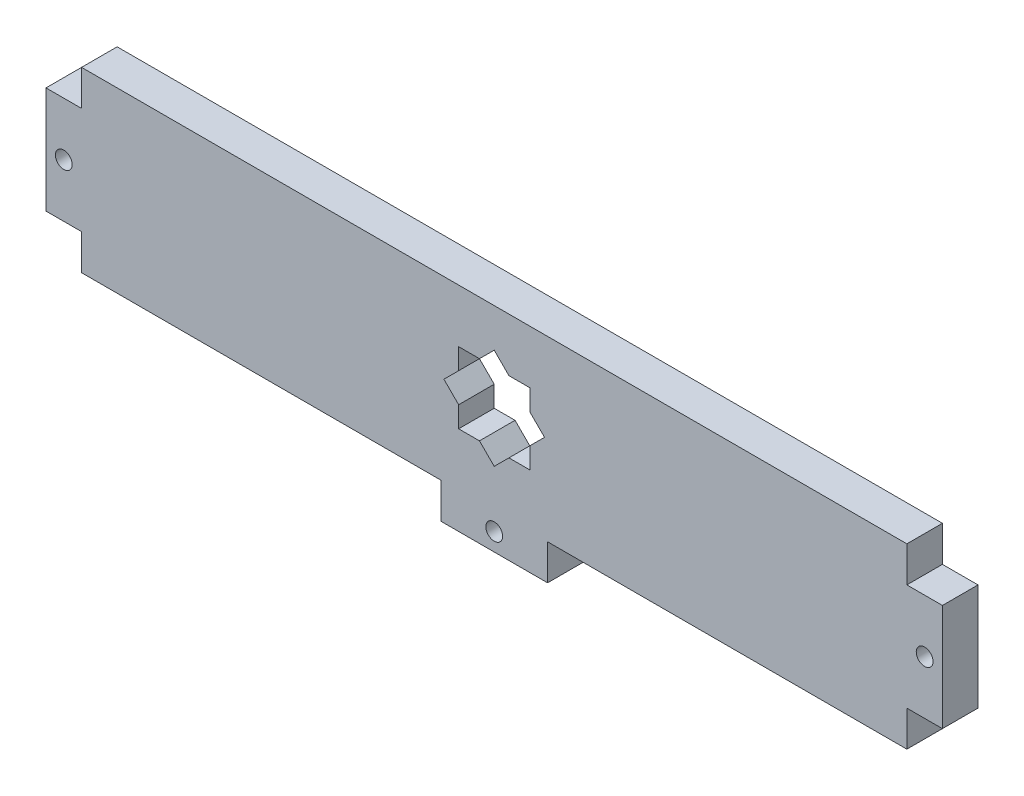
ISO-10303-21;
HEADER;
FILE_DESCRIPTION(('STEP AP214'),'2;1');
FILE_NAME('part.step','',(''),(''),'','','');
FILE_SCHEMA(('AUTOMOTIVE_DESIGN { 1 0 10303 214 1 1 1 1 }'));
ENDSEC;
DATA;
#1=APPLICATION_CONTEXT('core data for automotive mechanical design processes');
#2=APPLICATION_PROTOCOL_DEFINITION('international standard','automotive_design',2000,#1);
#3=PRODUCT_CONTEXT('',#1,'mechanical');
#4=PRODUCT('Part','Part','',(#3));
#5=PRODUCT_RELATED_PRODUCT_CATEGORY('part','',(#4));
#6=PRODUCT_DEFINITION_FORMATION('','',#4);
#7=PRODUCT_DEFINITION_CONTEXT('part definition',#1,'design');
#8=PRODUCT_DEFINITION('design','',#6,#7);
#9=PRODUCT_DEFINITION_SHAPE('','',#8);
#10=(LENGTH_UNIT() NAMED_UNIT(*) SI_UNIT(.MILLI.,.METRE.));
#11=(NAMED_UNIT(*) PLANE_ANGLE_UNIT() SI_UNIT($,.RADIAN.));
#12=(NAMED_UNIT(*) SI_UNIT($,.STERADIAN.) SOLID_ANGLE_UNIT());
#13=UNCERTAINTY_MEASURE_WITH_UNIT(LENGTH_MEASURE(1.E-05),#10,'distance_accuracy_value','');
#14=(GEOMETRIC_REPRESENTATION_CONTEXT(3) GLOBAL_UNCERTAINTY_ASSIGNED_CONTEXT((#13)) GLOBAL_UNIT_ASSIGNED_CONTEXT((#10,
#11,#12)) REPRESENTATION_CONTEXT('',''));
#15=CARTESIAN_POINT('',(0.,0.,0.));
#16=DIRECTION('',(0.,0.,1.));
#17=DIRECTION('',(1.,0.,0.));
#18=AXIS2_PLACEMENT_3D('',#15,#16,#17);
#19=CARTESIAN_POINT('',(-73.66,-15.875,-6.35));
#20=DIRECTION('',(0.,-1.,0.));
#21=DIRECTION('',(0.,0.,-1.));
#22=AXIS2_PLACEMENT_3D('',#19,#20,#21);
#23=PLANE('',#22);
#24=DIRECTION('',(1.,0.,0.));
#25=VECTOR('',#24,1.);
#26=CARTESIAN_POINT('',(-73.66,-15.875,-6.35));
#27=LINE('',#26,#25);
#28=CARTESIAN_POINT('',(-73.66,-15.875,-6.35));
#29=VERTEX_POINT('',#28);
#30=CARTESIAN_POINT('',(-9.52500000000007,-15.875,-6.35));
#31=VERTEX_POINT('',#30);
#32=EDGE_CURVE('E391',#29,#31,#27,.T.);
#33=ORIENTED_EDGE('',*,*,#32,.T.);
#34=DIRECTION('',(0.,0.,1.));
#35=VECTOR('',#34,1.);
#36=CARTESIAN_POINT('',(-9.52500000000007,-15.875,-6.35));
#37=LINE('',#36,#35);
#38=CARTESIAN_POINT('',(-9.52500000000007,-15.875,0.));
#39=VERTEX_POINT('',#38);
#40=EDGE_CURVE('E362',#31,#39,#37,.T.);
#41=ORIENTED_EDGE('',*,*,#40,.T.);
#42=DIRECTION('',(1.,0.,0.));
#43=VECTOR('',#42,1.);
#44=CARTESIAN_POINT('',(-73.66,-15.875,0.));
#45=LINE('',#44,#43);
#46=CARTESIAN_POINT('',(-73.66,-15.875,0.));
#47=VERTEX_POINT('',#46);
#48=EDGE_CURVE('E488',#47,#39,#45,.T.);
#49=ORIENTED_EDGE('',*,*,#48,.F.);
#50=DIRECTION('',(0.,0.,1.));
#51=VECTOR('',#50,1.);
#52=CARTESIAN_POINT('',(-73.66,-15.875,-6.35));
#53=LINE('',#52,#51);
#54=EDGE_CURVE('E41',#29,#47,#53,.T.);
#55=ORIENTED_EDGE('',*,*,#54,.F.);
#56=EDGE_LOOP('',(#33,#41,#49,#55));
#57=FACE_BOUND('',#56,.T.);
#58=ADVANCED_FACE('F32',(#57),#23,.T.);
#59=CARTESIAN_POINT('',(73.66,-15.875,-6.35));
#60=DIRECTION('',(1.,0.,0.));
#61=DIRECTION('',(0.,0.,-1.));
#62=AXIS2_PLACEMENT_3D('',#59,#60,#61);
#63=PLANE('',#62);
#64=DIRECTION('',(0.,1.,0.));
#65=VECTOR('',#64,1.);
#66=CARTESIAN_POINT('',(73.66,-15.875,-6.35));
#67=LINE('',#66,#65);
#68=CARTESIAN_POINT('',(73.66,-15.875,-6.35));
#69=VERTEX_POINT('',#68);
#70=CARTESIAN_POINT('',(73.66,-9.525,-6.35));
#71=VERTEX_POINT('',#70);
#72=EDGE_CURVE('E548',#69,#71,#67,.T.);
#73=ORIENTED_EDGE('',*,*,#72,.T.);
#74=DIRECTION('',(0.,0.,1.));
#75=VECTOR('',#74,1.);
#76=CARTESIAN_POINT('',(73.66,-9.525,-6.35));
#77=LINE('',#76,#75);
#78=CARTESIAN_POINT('',(73.66,-9.525,0.));
#79=VERTEX_POINT('',#78);
#80=EDGE_CURVE('E473',#71,#79,#77,.T.);
#81=ORIENTED_EDGE('',*,*,#80,.T.);
#82=DIRECTION('',(0.,1.,0.));
#83=VECTOR('',#82,1.);
#84=CARTESIAN_POINT('',(73.66,-15.875,0.));
#85=LINE('',#84,#83);
#86=CARTESIAN_POINT('',(73.66,-15.875,0.));
#87=VERTEX_POINT('',#86);
#88=EDGE_CURVE('E409',#87,#79,#85,.T.);
#89=ORIENTED_EDGE('',*,*,#88,.F.);
#90=DIRECTION('',(0.,0.,1.));
#91=VECTOR('',#90,1.);
#92=CARTESIAN_POINT('',(73.66,-15.875,-6.35));
#93=LINE('',#92,#91);
#94=EDGE_CURVE('E11',#69,#87,#93,.T.);
#95=ORIENTED_EDGE('',*,*,#94,.F.);
#96=EDGE_LOOP('',(#73,#81,#89,#95));
#97=FACE_BOUND('',#96,.T.);
#98=ADVANCED_FACE('F564',(#97),#63,.T.);
#99=CARTESIAN_POINT('',(-73.66,-15.875,-6.35));
#100=DIRECTION('',(-1.,0.,0.));
#101=DIRECTION('',(0.,0.,1.));
#102=AXIS2_PLACEMENT_3D('',#99,#100,#101);
#103=PLANE('',#102);
#104=DIRECTION('',(0.,-1.,0.));
#105=VECTOR('',#104,1.);
#106=CARTESIAN_POINT('',(-73.66,-15.875,-6.35));
#107=LINE('',#106,#105);
#108=CARTESIAN_POINT('',(-73.66,15.875,-6.35));
#109=VERTEX_POINT('',#108);
#110=CARTESIAN_POINT('',(-73.66,9.525,-6.35));
#111=VERTEX_POINT('',#110);
#112=EDGE_CURVE('E392',#109,#111,#107,.T.);
#113=ORIENTED_EDGE('',*,*,#112,.T.);
#114=DIRECTION('',(0.,0.,1.));
#115=VECTOR('',#114,1.);
#116=CARTESIAN_POINT('',(-73.66,9.525,-6.35));
#117=LINE('',#116,#115);
#118=CARTESIAN_POINT('',(-73.66,9.525,0.));
#119=VERTEX_POINT('',#118);
#120=EDGE_CURVE('E423',#111,#119,#117,.T.);
#121=ORIENTED_EDGE('',*,*,#120,.T.);
#122=DIRECTION('',(0.,-1.,0.));
#123=VECTOR('',#122,1.);
#124=CARTESIAN_POINT('',(-73.66,-15.875,0.));
#125=LINE('',#124,#123);
#126=CARTESIAN_POINT('',(-73.66,15.875,0.));
#127=VERTEX_POINT('',#126);
#128=EDGE_CURVE('E503',#127,#119,#125,.T.);
#129=ORIENTED_EDGE('',*,*,#128,.F.);
#130=DIRECTION('',(0.,0.,1.));
#131=VECTOR('',#130,1.);
#132=CARTESIAN_POINT('',(-73.66,15.875,-6.35));
#133=LINE('',#132,#131);
#134=EDGE_CURVE('E498',#109,#127,#133,.T.);
#135=ORIENTED_EDGE('',*,*,#134,.F.);
#136=EDGE_LOOP('',(#113,#121,#129,#135));
#137=FACE_BOUND('',#136,.T.);
#138=ADVANCED_FACE('F603',(#137),#103,.T.);
#139=DIRECTION('',(0.,0.,1.));
#140=VECTOR('',#139,1.);
#141=CARTESIAN_POINT('',(73.66,9.525,-6.35));
#142=LINE('',#141,#140);
#143=CARTESIAN_POINT('',(73.66,9.525,-6.35));
#144=VERTEX_POINT('',#143);
#145=CARTESIAN_POINT('',(73.66,9.525,0.));
#146=VERTEX_POINT('',#145);
#147=EDGE_CURVE('E464',#144,#146,#142,.T.);
#148=ORIENTED_EDGE('',*,*,#147,.F.);
#149=CARTESIAN_POINT('',(73.66,15.875,-6.35));
#150=VERTEX_POINT('',#149);
#151=EDGE_CURVE('E490',#144,#150,#67,.T.);
#152=ORIENTED_EDGE('',*,*,#151,.T.);
#153=DIRECTION('',(0.,0.,1.));
#154=VECTOR('',#153,1.);
#155=CARTESIAN_POINT('',(73.66,15.875,-6.35));
#156=LINE('',#155,#154);
#157=CARTESIAN_POINT('',(73.66,15.875,0.));
#158=VERTEX_POINT('',#157);
#159=EDGE_CURVE('E500',#150,#158,#156,.T.);
#160=ORIENTED_EDGE('',*,*,#159,.T.);
#161=EDGE_CURVE('E406',#146,#158,#85,.T.);
#162=ORIENTED_EDGE('',*,*,#161,.F.);
#163=EDGE_LOOP('',(#148,#152,#160,#162));
#164=FACE_BOUND('',#163,.T.);
#165=ADVANCED_FACE('F34',(#164),#63,.T.);
#166=DIRECTION('',(0.,0.,1.));
#167=VECTOR('',#166,1.);
#168=CARTESIAN_POINT('',(9.52499999999993,-15.875,-6.35));
#169=LINE('',#168,#167);
#170=CARTESIAN_POINT('',(9.52499999999993,-15.875,-6.35));
#171=VERTEX_POINT('',#170);
#172=CARTESIAN_POINT('',(9.52499999999993,-15.875,0.));
#173=VERTEX_POINT('',#172);
#174=EDGE_CURVE('E350',#171,#173,#169,.T.);
#175=ORIENTED_EDGE('',*,*,#174,.F.);
#176=EDGE_CURVE('E388',#171,#69,#27,.T.);
#177=ORIENTED_EDGE('',*,*,#176,.T.);
#178=ORIENTED_EDGE('',*,*,#94,.T.);
#179=EDGE_CURVE('E491',#173,#87,#45,.T.);
#180=ORIENTED_EDGE('',*,*,#179,.F.);
#181=EDGE_LOOP('',(#175,#177,#178,#180));
#182=FACE_BOUND('',#181,.T.);
#183=ADVANCED_FACE('F544',(#182),#23,.T.);
#184=DIRECTION('',(0.,0.,1.));
#185=VECTOR('',#184,1.);
#186=CARTESIAN_POINT('',(-73.66,-9.525,-6.35));
#187=LINE('',#186,#185);
#188=CARTESIAN_POINT('',(-73.66,-9.525,-6.35));
#189=VERTEX_POINT('',#188);
#190=CARTESIAN_POINT('',(-73.66,-9.525,0.));
#191=VERTEX_POINT('',#190);
#192=EDGE_CURVE('E425',#189,#191,#187,.T.);
#193=ORIENTED_EDGE('',*,*,#192,.F.);
#194=EDGE_CURVE('E510',#189,#29,#107,.T.);
#195=ORIENTED_EDGE('',*,*,#194,.T.);
#196=ORIENTED_EDGE('',*,*,#54,.T.);
#197=EDGE_CURVE('E506',#191,#47,#125,.T.);
#198=ORIENTED_EDGE('',*,*,#197,.F.);
#199=EDGE_LOOP('',(#193,#195,#196,#198));
#200=FACE_BOUND('',#199,.T.);
#201=ADVANCED_FACE('F524',(#200),#103,.T.);
#202=CARTESIAN_POINT('',(-73.66,15.875,-6.35));
#203=DIRECTION('',(0.,1.,0.));
#204=DIRECTION('',(0.,0.,1.));
#205=AXIS2_PLACEMENT_3D('',#202,#203,#204);
#206=PLANE('',#205);
#207=DIRECTION('',(-1.,0.,0.));
#208=VECTOR('',#207,1.);
#209=CARTESIAN_POINT('',(-73.66,15.875,0.));
#210=LINE('',#209,#208);
#211=EDGE_CURVE('E402',#158,#127,#210,.T.);
#212=ORIENTED_EDGE('',*,*,#211,.F.);
#213=ORIENTED_EDGE('',*,*,#159,.F.);
#214=DIRECTION('',(-1.,0.,0.));
#215=VECTOR('',#214,1.);
#216=CARTESIAN_POINT('',(-73.66,15.875,-6.35));
#217=LINE('',#216,#215);
#218=EDGE_CURVE('E511',#150,#109,#217,.T.);
#219=ORIENTED_EDGE('',*,*,#218,.T.);
#220=ORIENTED_EDGE('',*,*,#134,.T.);
#221=EDGE_LOOP('',(#212,#213,#219,#220));
#222=FACE_BOUND('',#221,.T.);
#223=ADVANCED_FACE('F610',(#222),#206,.T.);
#224=CARTESIAN_POINT('',(0.,0.,-6.35));
#225=DIRECTION('',(0.,0.,-1.));
#226=DIRECTION('',(-1.,0.,0.));
#227=AXIS2_PLACEMENT_3D('',#224,#225,#226);
#228=PLANE('',#227);
#229=DIRECTION('',(-0.707106781186547,0.707106781186548,0.));
#230=VECTOR('',#229,1.);
#231=CARTESIAN_POINT('',(2.63025612106915,6.35,-6.35));
#232=LINE('',#231,#230);
#233=CARTESIAN_POINT('',(2.63025612106915,6.35,-6.35));
#234=VERTEX_POINT('',#233);
#235=CARTESIAN_POINT('',(0.,8.98025612106915,-6.35));
#236=VERTEX_POINT('',#235);
#237=EDGE_CURVE('E257',#234,#236,#232,.T.);
#238=ORIENTED_EDGE('',*,*,#237,.T.);
#239=DIRECTION('',(-0.707106781186547,-0.707106781186548,0.));
#240=VECTOR('',#239,1.);
#241=CARTESIAN_POINT('',(-2.63025612106915,6.35,-6.35));
#242=LINE('',#241,#240);
#243=CARTESIAN_POINT('',(-2.63025612106915,6.35,-6.35));
#244=VERTEX_POINT('',#243);
#245=EDGE_CURVE('E244',#236,#244,#242,.T.);
#246=ORIENTED_EDGE('',*,*,#245,.T.);
#247=DIRECTION('',(-1.,0.,0.));
#248=VECTOR('',#247,1.);
#249=CARTESIAN_POINT('',(-6.35,6.35,-6.35));
#250=LINE('',#249,#248);
#251=CARTESIAN_POINT('',(-6.35,6.35,-6.35));
#252=VERTEX_POINT('',#251);
#253=EDGE_CURVE('E323',#244,#252,#250,.T.);
#254=ORIENTED_EDGE('',*,*,#253,.T.);
#255=DIRECTION('',(0.,-1.,0.));
#256=VECTOR('',#255,1.);
#257=CARTESIAN_POINT('',(-6.35,6.35,-6.35));
#258=LINE('',#257,#256);
#259=CARTESIAN_POINT('',(-6.35,2.63025612106915,-6.35));
#260=VERTEX_POINT('',#259);
#261=EDGE_CURVE('E319',#252,#260,#258,.T.);
#262=ORIENTED_EDGE('',*,*,#261,.T.);
#263=DIRECTION('',(-0.707106781186547,-0.707106781186548,0.));
#264=VECTOR('',#263,1.);
#265=CARTESIAN_POINT('',(-8.98025612106915,0.,-6.35));
#266=LINE('',#265,#264);
#267=CARTESIAN_POINT('',(-8.98025612106915,0.,-6.35));
#268=VERTEX_POINT('',#267);
#269=EDGE_CURVE('E315',#260,#268,#266,.T.);
#270=ORIENTED_EDGE('',*,*,#269,.T.);
#271=DIRECTION('',(0.707106781186548,-0.707106781186547,0.));
#272=VECTOR('',#271,1.);
#273=CARTESIAN_POINT('',(-6.35,-2.63025612106916,-6.35));
#274=LINE('',#273,#272);
#275=CARTESIAN_POINT('',(-6.35,-2.63025612106916,-6.35));
#276=VERTEX_POINT('',#275);
#277=EDGE_CURVE('E311',#268,#276,#274,.T.);
#278=ORIENTED_EDGE('',*,*,#277,.T.);
#279=DIRECTION('',(0.,-1.,0.));
#280=VECTOR('',#279,1.);
#281=CARTESIAN_POINT('',(-6.35,-6.35,-6.35));
#282=LINE('',#281,#280);
#283=CARTESIAN_POINT('',(-6.35,-6.35,-6.35));
#284=VERTEX_POINT('',#283);
#285=EDGE_CURVE('E307',#276,#284,#282,.T.);
#286=ORIENTED_EDGE('',*,*,#285,.T.);
#287=DIRECTION('',(1.,0.,0.));
#288=VECTOR('',#287,1.);
#289=CARTESIAN_POINT('',(-6.35,-6.35,-6.35));
#290=LINE('',#289,#288);
#291=CARTESIAN_POINT('',(-2.63025612106916,-6.35,-6.35));
#292=VERTEX_POINT('',#291);
#293=EDGE_CURVE('E303',#284,#292,#290,.T.);
#294=ORIENTED_EDGE('',*,*,#293,.T.);
#295=DIRECTION('',(0.707106781186548,-0.707106781186547,0.));
#296=VECTOR('',#295,1.);
#297=CARTESIAN_POINT('',(0.,-8.98025612106916,-6.35));
#298=LINE('',#297,#296);
#299=CARTESIAN_POINT('',(0.,-8.98025612106916,-6.35));
#300=VERTEX_POINT('',#299);
#301=EDGE_CURVE('E299',#292,#300,#298,.T.);
#302=ORIENTED_EDGE('',*,*,#301,.T.);
#303=DIRECTION('',(0.707106781186547,0.707106781186548,0.));
#304=VECTOR('',#303,1.);
#305=CARTESIAN_POINT('',(0.,-8.98025612106916,-6.35));
#306=LINE('',#305,#304);
#307=CARTESIAN_POINT('',(2.63025612106915,-6.35,-6.35));
#308=VERTEX_POINT('',#307);
#309=EDGE_CURVE('E295',#300,#308,#306,.T.);
#310=ORIENTED_EDGE('',*,*,#309,.T.);
#311=DIRECTION('',(1.,0.,0.));
#312=VECTOR('',#311,1.);
#313=CARTESIAN_POINT('',(2.63025612106915,-6.35,-6.35));
#314=LINE('',#313,#312);
#315=CARTESIAN_POINT('',(6.35,-6.35,-6.35));
#316=VERTEX_POINT('',#315);
#317=EDGE_CURVE('E291',#308,#316,#314,.T.);
#318=ORIENTED_EDGE('',*,*,#317,.T.);
#319=DIRECTION('',(0.,1.,0.));
#320=VECTOR('',#319,1.);
#321=CARTESIAN_POINT('',(6.35,-6.35,-6.35));
#322=LINE('',#321,#320);
#323=CARTESIAN_POINT('',(6.35,-2.63025612106915,-6.35));
#324=VERTEX_POINT('',#323);
#325=EDGE_CURVE('E287',#316,#324,#322,.T.);
#326=ORIENTED_EDGE('',*,*,#325,.T.);
#327=DIRECTION('',(0.707106781186548,0.707106781186547,0.));
#328=VECTOR('',#327,1.);
#329=CARTESIAN_POINT('',(6.35,-2.63025612106915,-6.35));
#330=LINE('',#329,#328);
#331=CARTESIAN_POINT('',(8.98025612106916,0.,-6.35));
#332=VERTEX_POINT('',#331);
#333=EDGE_CURVE('E283',#324,#332,#330,.T.);
#334=ORIENTED_EDGE('',*,*,#333,.T.);
#335=DIRECTION('',(-0.707106781186547,0.707106781186548,0.));
#336=VECTOR('',#335,1.);
#337=CARTESIAN_POINT('',(8.98025612106916,0.,-6.35));
#338=LINE('',#337,#336);
#339=CARTESIAN_POINT('',(6.35,2.63025612106915,-6.35));
#340=VERTEX_POINT('',#339);
#341=EDGE_CURVE('E279',#332,#340,#338,.T.);
#342=ORIENTED_EDGE('',*,*,#341,.T.);
#343=DIRECTION('',(0.,1.,0.));
#344=VECTOR('',#343,1.);
#345=CARTESIAN_POINT('',(6.35,2.63025612106915,-6.35));
#346=LINE('',#345,#344);
#347=CARTESIAN_POINT('',(6.35,6.35,-6.35));
#348=VERTEX_POINT('',#347);
#349=EDGE_CURVE('E276',#340,#348,#346,.T.);
#350=ORIENTED_EDGE('',*,*,#349,.T.);
#351=DIRECTION('',(-1.,0.,0.));
#352=VECTOR('',#351,1.);
#353=CARTESIAN_POINT('',(2.63025612106915,6.35,-6.35));
#354=LINE('',#353,#352);
#355=EDGE_CURVE('E266',#348,#234,#354,.T.);
#356=ORIENTED_EDGE('',*,*,#355,.T.);
#357=EDGE_LOOP('',(#238,#246,#254,#262,#270,#278,#286,#294,#302,#310,#318,#326,#334,#342,#350,#356));
#358=FACE_BOUND('',#357,.T.);
#359=ORIENTED_EDGE('',*,*,#72,.F.);
#360=ORIENTED_EDGE('',*,*,#176,.F.);
#361=DIRECTION('',(0.,1.,0.));
#362=VECTOR('',#361,1.);
#363=CARTESIAN_POINT('',(9.52499999999993,-22.225,-6.35));
#364=LINE('',#363,#362);
#365=CARTESIAN_POINT('',(9.52499999999993,-22.225,-6.35));
#366=VERTEX_POINT('',#365);
#367=EDGE_CURVE('E355',#366,#171,#364,.T.);
#368=ORIENTED_EDGE('',*,*,#367,.F.);
#369=DIRECTION('',(1.,0.,0.));
#370=VECTOR('',#369,1.);
#371=CARTESIAN_POINT('',(-9.52500000000007,-22.225,-6.35));
#372=LINE('',#371,#370);
#373=CARTESIAN_POINT('',(-9.52500000000007,-22.225,-6.35));
#374=VERTEX_POINT('',#373);
#375=EDGE_CURVE('E347',#374,#366,#372,.T.);
#376=ORIENTED_EDGE('',*,*,#375,.F.);
#377=DIRECTION('',(0.,-1.,0.));
#378=VECTOR('',#377,1.);
#379=CARTESIAN_POINT('',(-9.52500000000007,-22.225,-6.35));
#380=LINE('',#379,#378);
#381=EDGE_CURVE('E351',#31,#374,#380,.T.);
#382=ORIENTED_EDGE('',*,*,#381,.F.);
#383=ORIENTED_EDGE('',*,*,#32,.F.);
#384=ORIENTED_EDGE('',*,*,#194,.F.);
#385=DIRECTION('',(1.,0.,0.));
#386=VECTOR('',#385,1.);
#387=CARTESIAN_POINT('',(-80.01,-9.525,-6.35));
#388=LINE('',#387,#386);
#389=CARTESIAN_POINT('',(-80.01,-9.525,-6.35));
#390=VERTEX_POINT('',#389);
#391=EDGE_CURVE('E421',#390,#189,#388,.T.);
#392=ORIENTED_EDGE('',*,*,#391,.F.);
#393=DIRECTION('',(0.,-1.,0.));
#394=VECTOR('',#393,1.);
#395=CARTESIAN_POINT('',(-80.01,-9.525,-6.35));
#396=LINE('',#395,#394);
#397=CARTESIAN_POINT('',(-80.01,9.525,-6.35));
#398=VERTEX_POINT('',#397);
#399=EDGE_CURVE('E424',#398,#390,#396,.T.);
#400=ORIENTED_EDGE('',*,*,#399,.F.);
#401=DIRECTION('',(-1.,0.,0.));
#402=VECTOR('',#401,1.);
#403=CARTESIAN_POINT('',(-80.01,9.525,-6.35));
#404=LINE('',#403,#402);
#405=EDGE_CURVE('E417',#111,#398,#404,.T.);
#406=ORIENTED_EDGE('',*,*,#405,.F.);
#407=ORIENTED_EDGE('',*,*,#112,.F.);
#408=ORIENTED_EDGE('',*,*,#218,.F.);
#409=ORIENTED_EDGE('',*,*,#151,.F.);
#410=DIRECTION('',(-1.,0.,0.));
#411=VECTOR('',#410,1.);
#412=CARTESIAN_POINT('',(80.01,9.525,-6.35));
#413=LINE('',#412,#411);
#414=CARTESIAN_POINT('',(80.01,9.525,-6.35));
#415=VERTEX_POINT('',#414);
#416=EDGE_CURVE('E476',#415,#144,#413,.T.);
#417=ORIENTED_EDGE('',*,*,#416,.F.);
#418=DIRECTION('',(0.,1.,0.));
#419=VECTOR('',#418,1.);
#420=CARTESIAN_POINT('',(80.01,-9.525,-6.35));
#421=LINE('',#420,#419);
#422=CARTESIAN_POINT('',(80.01,-9.525,-6.35));
#423=VERTEX_POINT('',#422);
#424=EDGE_CURVE('E478',#423,#415,#421,.T.);
#425=ORIENTED_EDGE('',*,*,#424,.F.);
#426=DIRECTION('',(1.,0.,0.));
#427=VECTOR('',#426,1.);
#428=CARTESIAN_POINT('',(80.01,-9.525,-6.35));
#429=LINE('',#428,#427);
#430=EDGE_CURVE('E465',#71,#423,#429,.T.);
#431=ORIENTED_EDGE('',*,*,#430,.F.);
#432=EDGE_LOOP('',(#359,#360,#368,#376,#382,#383,#384,#392,#400,#406,#407,#408,#409,#417,#425,#431));
#433=FACE_BOUND('',#432,.T.);
#434=CARTESIAN_POINT('',(-76.835,0.,-6.35));
#435=DIRECTION('',(0.,0.,1.));
#436=DIRECTION('',(1.,0.,0.));
#437=AXIS2_PLACEMENT_3D('',#434,#435,#436);
#438=CIRCLE('',#437,1.5);
#439=CARTESIAN_POINT('',(-75.335,0.,-6.35));
#440=VERTEX_POINT('',#439);
#441=EDGE_CURVE('E457',#440,#440,#438,.T.);
#442=ORIENTED_EDGE('',*,*,#441,.T.);
#443=EDGE_LOOP('',(#442));
#444=FACE_BOUND('',#443,.T.);
#445=CARTESIAN_POINT('',(76.835,0.,-6.35));
#446=DIRECTION('',(0.,0.,1.));
#447=DIRECTION('',(-1.,0.,0.));
#448=AXIS2_PLACEMENT_3D('',#445,#446,#447);
#449=CIRCLE('',#448,1.5);
#450=CARTESIAN_POINT('',(75.335,0.,-6.35));
#451=VERTEX_POINT('',#450);
#452=EDGE_CURVE('E569',#451,#451,#449,.T.);
#453=ORIENTED_EDGE('',*,*,#452,.T.);
#454=EDGE_LOOP('',(#453));
#455=FACE_BOUND('',#454,.T.);
#456=CARTESIAN_POINT('',(0.,-19.05,-6.35));
#457=DIRECTION('',(0.,0.,1.));
#458=DIRECTION('',(1.,0.,0.));
#459=AXIS2_PLACEMENT_3D('',#456,#457,#458);
#460=CIRCLE('',#459,1.5);
#461=CARTESIAN_POINT('',(1.49999999999993,-19.05,-6.35));
#462=VERTEX_POINT('',#461);
#463=EDGE_CURVE('E341',#462,#462,#460,.T.);
#464=ORIENTED_EDGE('',*,*,#463,.T.);
#465=EDGE_LOOP('',(#464));
#466=FACE_BOUND('',#465,.T.);
#467=ADVANCED_FACE('F263',(#358,#433,#444,#455,#466),#228,.T.);
#468=CARTESIAN_POINT('',(0.,0.,0.));
#469=DIRECTION('',(0.,0.,-1.));
#470=DIRECTION('',(-1.,0.,0.));
#471=AXIS2_PLACEMENT_3D('',#468,#469,#470);
#472=PLANE('',#471);
#473=DIRECTION('',(-0.707106781186547,-0.707106781186548,0.));
#474=VECTOR('',#473,1.);
#475=CARTESIAN_POINT('',(-2.63025612106915,6.35,0.));
#476=LINE('',#475,#474);
#477=CARTESIAN_POINT('',(0.,8.98025612106915,0.));
#478=VERTEX_POINT('',#477);
#479=CARTESIAN_POINT('',(-2.63025612106915,6.35,0.));
#480=VERTEX_POINT('',#479);
#481=EDGE_CURVE('E907',#478,#480,#476,.T.);
#482=ORIENTED_EDGE('',*,*,#481,.F.);
#483=DIRECTION('',(-0.707106781186547,0.707106781186548,0.));
#484=VECTOR('',#483,1.);
#485=CARTESIAN_POINT('',(2.63025612106915,6.35,0.));
#486=LINE('',#485,#484);
#487=CARTESIAN_POINT('',(2.63025612106915,6.35,0.));
#488=VERTEX_POINT('',#487);
#489=EDGE_CURVE('E260',#488,#478,#486,.T.);
#490=ORIENTED_EDGE('',*,*,#489,.F.);
#491=DIRECTION('',(-1.,0.,0.));
#492=VECTOR('',#491,1.);
#493=CARTESIAN_POINT('',(2.63025612106915,6.35,0.));
#494=LINE('',#493,#492);
#495=CARTESIAN_POINT('',(6.35,6.35,0.));
#496=VERTEX_POINT('',#495);
#497=EDGE_CURVE('E272',#496,#488,#494,.T.);
#498=ORIENTED_EDGE('',*,*,#497,.F.);
#499=DIRECTION('',(0.,1.,0.));
#500=VECTOR('',#499,1.);
#501=CARTESIAN_POINT('',(6.35,2.63025612106915,0.));
#502=LINE('',#501,#500);
#503=CARTESIAN_POINT('',(6.35,2.63025612106915,0.));
#504=VERTEX_POINT('',#503);
#505=EDGE_CURVE('E57',#504,#496,#502,.T.);
#506=ORIENTED_EDGE('',*,*,#505,.F.);
#507=DIRECTION('',(-0.707106781186547,0.707106781186548,0.));
#508=VECTOR('',#507,1.);
#509=CARTESIAN_POINT('',(8.98025612106916,0.,0.));
#510=LINE('',#509,#508);
#511=CARTESIAN_POINT('',(8.98025612106916,0.,0.));
#512=VERTEX_POINT('',#511);
#513=EDGE_CURVE('E268',#512,#504,#510,.T.);
#514=ORIENTED_EDGE('',*,*,#513,.F.);
#515=DIRECTION('',(0.707106781186548,0.707106781186547,0.));
#516=VECTOR('',#515,1.);
#517=CARTESIAN_POINT('',(6.35,-2.63025612106915,0.));
#518=LINE('',#517,#516);
#519=CARTESIAN_POINT('',(6.35,-2.63025612106915,0.));
#520=VERTEX_POINT('',#519);
#521=EDGE_CURVE('E940',#520,#512,#518,.T.);
#522=ORIENTED_EDGE('',*,*,#521,.F.);
#523=DIRECTION('',(0.,1.,0.));
#524=VECTOR('',#523,1.);
#525=CARTESIAN_POINT('',(6.35,-6.35,0.));
#526=LINE('',#525,#524);
#527=CARTESIAN_POINT('',(6.35,-6.35,0.));
#528=VERTEX_POINT('',#527);
#529=EDGE_CURVE('E937',#528,#520,#526,.T.);
#530=ORIENTED_EDGE('',*,*,#529,.F.);
#531=DIRECTION('',(1.,0.,0.));
#532=VECTOR('',#531,1.);
#533=CARTESIAN_POINT('',(2.63025612106915,-6.35,0.));
#534=LINE('',#533,#532);
#535=CARTESIAN_POINT('',(2.63025612106915,-6.35,0.));
#536=VERTEX_POINT('',#535);
#537=EDGE_CURVE('E934',#536,#528,#534,.T.);
#538=ORIENTED_EDGE('',*,*,#537,.F.);
#539=DIRECTION('',(0.707106781186547,0.707106781186548,0.));
#540=VECTOR('',#539,1.);
#541=CARTESIAN_POINT('',(0.,-8.98025612106916,0.));
#542=LINE('',#541,#540);
#543=CARTESIAN_POINT('',(0.,-8.98025612106916,0.));
#544=VERTEX_POINT('',#543);
#545=EDGE_CURVE('E931',#544,#536,#542,.T.);
#546=ORIENTED_EDGE('',*,*,#545,.F.);
#547=DIRECTION('',(0.707106781186548,-0.707106781186547,0.));
#548=VECTOR('',#547,1.);
#549=CARTESIAN_POINT('',(0.,-8.98025612106916,0.));
#550=LINE('',#549,#548);
#551=CARTESIAN_POINT('',(-2.63025612106916,-6.35,0.));
#552=VERTEX_POINT('',#551);
#553=EDGE_CURVE('E928',#552,#544,#550,.T.);
#554=ORIENTED_EDGE('',*,*,#553,.F.);
#555=DIRECTION('',(1.,0.,0.));
#556=VECTOR('',#555,1.);
#557=CARTESIAN_POINT('',(-6.35,-6.35,0.));
#558=LINE('',#557,#556);
#559=CARTESIAN_POINT('',(-6.35,-6.35,0.));
#560=VERTEX_POINT('',#559);
#561=EDGE_CURVE('E925',#560,#552,#558,.T.);
#562=ORIENTED_EDGE('',*,*,#561,.F.);
#563=DIRECTION('',(0.,-1.,0.));
#564=VECTOR('',#563,1.);
#565=CARTESIAN_POINT('',(-6.35,-6.35,0.));
#566=LINE('',#565,#564);
#567=CARTESIAN_POINT('',(-6.35,-2.63025612106916,0.));
#568=VERTEX_POINT('',#567);
#569=EDGE_CURVE('E922',#568,#560,#566,.T.);
#570=ORIENTED_EDGE('',*,*,#569,.F.);
#571=DIRECTION('',(0.707106781186548,-0.707106781186547,0.));
#572=VECTOR('',#571,1.);
#573=CARTESIAN_POINT('',(-6.35,-2.63025612106916,0.));
#574=LINE('',#573,#572);
#575=CARTESIAN_POINT('',(-8.98025612106915,0.,0.));
#576=VERTEX_POINT('',#575);
#577=EDGE_CURVE('E919',#576,#568,#574,.T.);
#578=ORIENTED_EDGE('',*,*,#577,.F.);
#579=DIRECTION('',(-0.707106781186547,-0.707106781186548,0.));
#580=VECTOR('',#579,1.);
#581=CARTESIAN_POINT('',(-8.98025612106915,0.,0.));
#582=LINE('',#581,#580);
#583=CARTESIAN_POINT('',(-6.35,2.63025612106915,0.));
#584=VERTEX_POINT('',#583);
#585=EDGE_CURVE('E916',#584,#576,#582,.T.);
#586=ORIENTED_EDGE('',*,*,#585,.F.);
#587=DIRECTION('',(0.,-1.,0.));
#588=VECTOR('',#587,1.);
#589=CARTESIAN_POINT('',(-6.35,6.35,0.));
#590=LINE('',#589,#588);
#591=CARTESIAN_POINT('',(-6.35,6.35,0.));
#592=VERTEX_POINT('',#591);
#593=EDGE_CURVE('E913',#592,#584,#590,.T.);
#594=ORIENTED_EDGE('',*,*,#593,.F.);
#595=DIRECTION('',(-1.,0.,0.));
#596=VECTOR('',#595,1.);
#597=CARTESIAN_POINT('',(-6.35,6.35,0.));
#598=LINE('',#597,#596);
#599=EDGE_CURVE('E908',#480,#592,#598,.T.);
#600=ORIENTED_EDGE('',*,*,#599,.F.);
#601=EDGE_LOOP('',(#482,#490,#498,#506,#514,#522,#530,#538,#546,#554,#562,#570,#578,#586,#594,#600));
#602=FACE_BOUND('',#601,.T.);
#603=ORIENTED_EDGE('',*,*,#88,.T.);
#604=DIRECTION('',(1.,0.,0.));
#605=VECTOR('',#604,1.);
#606=CARTESIAN_POINT('',(80.01,-9.525,0.));
#607=LINE('',#606,#605);
#608=CARTESIAN_POINT('',(80.01,-9.525,0.));
#609=VERTEX_POINT('',#608);
#610=EDGE_CURVE('E484',#79,#609,#607,.T.);
#611=ORIENTED_EDGE('',*,*,#610,.T.);
#612=DIRECTION('',(0.,1.,0.));
#613=VECTOR('',#612,1.);
#614=CARTESIAN_POINT('',(80.01,-9.525,0.));
#615=LINE('',#614,#613);
#616=CARTESIAN_POINT('',(80.01,9.525,0.));
#617=VERTEX_POINT('',#616);
#618=EDGE_CURVE('E485',#609,#617,#615,.T.);
#619=ORIENTED_EDGE('',*,*,#618,.T.);
#620=DIRECTION('',(-1.,0.,0.));
#621=VECTOR('',#620,1.);
#622=CARTESIAN_POINT('',(80.01,9.525,0.));
#623=LINE('',#622,#621);
#624=EDGE_CURVE('E481',#617,#146,#623,.T.);
#625=ORIENTED_EDGE('',*,*,#624,.T.);
#626=ORIENTED_EDGE('',*,*,#161,.T.);
#627=ORIENTED_EDGE('',*,*,#211,.T.);
#628=ORIENTED_EDGE('',*,*,#128,.T.);
#629=DIRECTION('',(-1.,0.,0.));
#630=VECTOR('',#629,1.);
#631=CARTESIAN_POINT('',(-80.01,9.525,0.));
#632=LINE('',#631,#630);
#633=CARTESIAN_POINT('',(-80.01,9.525,0.));
#634=VERTEX_POINT('',#633);
#635=EDGE_CURVE('E461',#119,#634,#632,.T.);
#636=ORIENTED_EDGE('',*,*,#635,.T.);
#637=DIRECTION('',(0.,-1.,0.));
#638=VECTOR('',#637,1.);
#639=CARTESIAN_POINT('',(-80.01,-9.525,0.));
#640=LINE('',#639,#638);
#641=CARTESIAN_POINT('',(-80.01,-9.525,0.));
#642=VERTEX_POINT('',#641);
#643=EDGE_CURVE('E418',#634,#642,#640,.T.);
#644=ORIENTED_EDGE('',*,*,#643,.T.);
#645=DIRECTION('',(1.,0.,0.));
#646=VECTOR('',#645,1.);
#647=CARTESIAN_POINT('',(-80.01,-9.525,0.));
#648=LINE('',#647,#646);
#649=EDGE_CURVE('E414',#642,#191,#648,.T.);
#650=ORIENTED_EDGE('',*,*,#649,.T.);
#651=ORIENTED_EDGE('',*,*,#197,.T.);
#652=ORIENTED_EDGE('',*,*,#48,.T.);
#653=DIRECTION('',(0.,-1.,0.));
#654=VECTOR('',#653,1.);
#655=CARTESIAN_POINT('',(-9.52500000000007,-22.225,0.));
#656=LINE('',#655,#654);
#657=CARTESIAN_POINT('',(-9.52500000000007,-22.225,0.));
#658=VERTEX_POINT('',#657);
#659=EDGE_CURVE('E356',#39,#658,#656,.T.);
#660=ORIENTED_EDGE('',*,*,#659,.T.);
#661=DIRECTION('',(1.,0.,0.));
#662=VECTOR('',#661,1.);
#663=CARTESIAN_POINT('',(-9.52500000000007,-22.225,0.));
#664=LINE('',#663,#662);
#665=CARTESIAN_POINT('',(9.52499999999993,-22.225,0.));
#666=VERTEX_POINT('',#665);
#667=EDGE_CURVE('E352',#658,#666,#664,.T.);
#668=ORIENTED_EDGE('',*,*,#667,.T.);
#669=DIRECTION('',(0.,1.,0.));
#670=VECTOR('',#669,1.);
#671=CARTESIAN_POINT('',(9.52499999999993,-22.225,0.));
#672=LINE('',#671,#670);
#673=EDGE_CURVE('E344',#666,#173,#672,.T.);
#674=ORIENTED_EDGE('',*,*,#673,.T.);
#675=ORIENTED_EDGE('',*,*,#179,.T.);
#676=EDGE_LOOP('',(#603,#611,#619,#625,#626,#627,#628,#636,#644,#650,#651,#652,#660,#668,#674,#675));
#677=FACE_BOUND('',#676,.T.);
#678=CARTESIAN_POINT('',(-76.835,0.,0.));
#679=DIRECTION('',(0.,0.,1.));
#680=DIRECTION('',(1.,0.,0.));
#681=AXIS2_PLACEMENT_3D('',#678,#679,#680);
#682=CIRCLE('',#681,1.5);
#683=CARTESIAN_POINT('',(-75.335,0.,0.));
#684=VERTEX_POINT('',#683);
#685=EDGE_CURVE('E454',#684,#684,#682,.T.);
#686=ORIENTED_EDGE('',*,*,#685,.F.);
#687=EDGE_LOOP('',(#686));
#688=FACE_BOUND('',#687,.T.);
#689=CARTESIAN_POINT('',(76.835,0.,0.));
#690=DIRECTION('',(0.,0.,1.));
#691=DIRECTION('',(-1.,0.,0.));
#692=AXIS2_PLACEMENT_3D('',#689,#690,#691);
#693=CIRCLE('',#692,1.5);
#694=CARTESIAN_POINT('',(75.335,0.,0.));
#695=VERTEX_POINT('',#694);
#696=EDGE_CURVE('E359',#695,#695,#693,.T.);
#697=ORIENTED_EDGE('',*,*,#696,.F.);
#698=EDGE_LOOP('',(#697));
#699=FACE_BOUND('',#698,.T.);
#700=CARTESIAN_POINT('',(0.,-19.05,0.));
#701=DIRECTION('',(0.,0.,1.));
#702=DIRECTION('',(1.,0.,0.));
#703=AXIS2_PLACEMENT_3D('',#700,#701,#702);
#704=CIRCLE('',#703,1.5);
#705=CARTESIAN_POINT('',(1.49999999999993,-19.05,0.));
#706=VERTEX_POINT('',#705);
#707=EDGE_CURVE('E340',#706,#706,#704,.T.);
#708=ORIENTED_EDGE('',*,*,#707,.F.);
#709=EDGE_LOOP('',(#708));
#710=FACE_BOUND('',#709,.T.);
#711=ADVANCED_FACE('F516',(#602,#677,#688,#699,#710),#472,.F.);
#712=CARTESIAN_POINT('',(-80.01,-9.525,-6.35));
#713=DIRECTION('',(0.,-1.,0.));
#714=DIRECTION('',(0.,0.,-1.));
#715=AXIS2_PLACEMENT_3D('',#712,#713,#714);
#716=PLANE('',#715);
#717=ORIENTED_EDGE('',*,*,#649,.F.);
#718=DIRECTION('',(0.,0.,1.));
#719=VECTOR('',#718,1.);
#720=CARTESIAN_POINT('',(-80.01,-9.525,-6.35));
#721=LINE('',#720,#719);
#722=EDGE_CURVE('E428',#390,#642,#721,.T.);
#723=ORIENTED_EDGE('',*,*,#722,.F.);
#724=ORIENTED_EDGE('',*,*,#391,.T.);
#725=ORIENTED_EDGE('',*,*,#192,.T.);
#726=EDGE_LOOP('',(#717,#723,#724,#725));
#727=FACE_BOUND('',#726,.T.);
#728=ADVANCED_FACE('F520',(#727),#716,.T.);
#729=CARTESIAN_POINT('',(-80.01,-9.525,-6.35));
#730=DIRECTION('',(-1.,0.,0.));
#731=DIRECTION('',(0.,0.,1.));
#732=AXIS2_PLACEMENT_3D('',#729,#730,#731);
#733=PLANE('',#732);
#734=ORIENTED_EDGE('',*,*,#643,.F.);
#735=DIRECTION('',(0.,0.,1.));
#736=VECTOR('',#735,1.);
#737=CARTESIAN_POINT('',(-80.01,9.525,-6.35));
#738=LINE('',#737,#736);
#739=EDGE_CURVE('E436',#398,#634,#738,.T.);
#740=ORIENTED_EDGE('',*,*,#739,.F.);
#741=ORIENTED_EDGE('',*,*,#399,.T.);
#742=ORIENTED_EDGE('',*,*,#722,.T.);
#743=EDGE_LOOP('',(#734,#740,#741,#742));
#744=FACE_BOUND('',#743,.T.);
#745=ADVANCED_FACE('F628',(#744),#733,.T.);
#746=CARTESIAN_POINT('',(-80.01,9.525,-6.35));
#747=DIRECTION('',(0.,1.,0.));
#748=DIRECTION('',(0.,0.,1.));
#749=AXIS2_PLACEMENT_3D('',#746,#747,#748);
#750=PLANE('',#749);
#751=ORIENTED_EDGE('',*,*,#635,.F.);
#752=ORIENTED_EDGE('',*,*,#120,.F.);
#753=ORIENTED_EDGE('',*,*,#405,.T.);
#754=ORIENTED_EDGE('',*,*,#739,.T.);
#755=EDGE_LOOP('',(#751,#752,#753,#754));
#756=FACE_BOUND('',#755,.T.);
#757=ADVANCED_FACE('F627',(#756),#750,.T.);
#758=CARTESIAN_POINT('',(-76.835,0.,-6.35));
#759=DIRECTION('',(0.,0.,1.));
#760=DIRECTION('',(1.,0.,0.));
#761=AXIS2_PLACEMENT_3D('',#758,#759,#760);
#762=CYLINDRICAL_SURFACE('',#761,1.5);
#763=ORIENTED_EDGE('',*,*,#441,.F.);
#764=EDGE_LOOP('',(#763));
#765=FACE_BOUND('',#764,.T.);
#766=ORIENTED_EDGE('',*,*,#685,.T.);
#767=EDGE_LOOP('',(#766));
#768=FACE_BOUND('',#767,.T.);
#769=ADVANCED_FACE('F635',(#765,#768),#762,.F.);
#770=CARTESIAN_POINT('',(80.01,-9.525,-6.35));
#771=DIRECTION('',(1.,0.,0.));
#772=DIRECTION('',(0.,0.,-1.));
#773=AXIS2_PLACEMENT_3D('',#770,#771,#772);
#774=PLANE('',#773);
#775=ORIENTED_EDGE('',*,*,#618,.F.);
#776=DIRECTION('',(0.,0.,1.));
#777=VECTOR('',#776,1.);
#778=CARTESIAN_POINT('',(80.01,-9.525,-6.35));
#779=LINE('',#778,#777);
#780=EDGE_CURVE('E458',#423,#609,#779,.T.);
#781=ORIENTED_EDGE('',*,*,#780,.F.);
#782=ORIENTED_EDGE('',*,*,#424,.T.);
#783=DIRECTION('',(0.,0.,1.));
#784=VECTOR('',#783,1.);
#785=CARTESIAN_POINT('',(80.01,9.525,-6.35));
#786=LINE('',#785,#784);
#787=EDGE_CURVE('E462',#415,#617,#786,.T.);
#788=ORIENTED_EDGE('',*,*,#787,.T.);
#789=EDGE_LOOP('',(#775,#781,#782,#788));
#790=FACE_BOUND('',#789,.T.);
#791=ADVANCED_FACE('F678',(#790),#774,.T.);
#792=CARTESIAN_POINT('',(80.01,-9.525,-6.35));
#793=DIRECTION('',(0.,-1.,0.));
#794=DIRECTION('',(0.,0.,-1.));
#795=AXIS2_PLACEMENT_3D('',#792,#793,#794);
#796=PLANE('',#795);
#797=ORIENTED_EDGE('',*,*,#610,.F.);
#798=ORIENTED_EDGE('',*,*,#80,.F.);
#799=ORIENTED_EDGE('',*,*,#430,.T.);
#800=ORIENTED_EDGE('',*,*,#780,.T.);
#801=EDGE_LOOP('',(#797,#798,#799,#800));
#802=FACE_BOUND('',#801,.T.);
#803=ADVANCED_FACE('F561',(#802),#796,.T.);
#804=CARTESIAN_POINT('',(80.01,9.525,-6.35));
#805=DIRECTION('',(0.,1.,0.));
#806=DIRECTION('',(0.,0.,1.));
#807=AXIS2_PLACEMENT_3D('',#804,#805,#806);
#808=PLANE('',#807);
#809=ORIENTED_EDGE('',*,*,#624,.F.);
#810=ORIENTED_EDGE('',*,*,#787,.F.);
#811=ORIENTED_EDGE('',*,*,#416,.T.);
#812=ORIENTED_EDGE('',*,*,#147,.T.);
#813=EDGE_LOOP('',(#809,#810,#811,#812));
#814=FACE_BOUND('',#813,.T.);
#815=ADVANCED_FACE('F695',(#814),#808,.T.);
#816=CARTESIAN_POINT('',(76.835,0.,-6.35));
#817=DIRECTION('',(0.,0.,1.));
#818=DIRECTION('',(1.,0.,0.));
#819=AXIS2_PLACEMENT_3D('',#816,#817,#818);
#820=CYLINDRICAL_SURFACE('',#819,1.5);
#821=ORIENTED_EDGE('',*,*,#452,.F.);
#822=EDGE_LOOP('',(#821));
#823=FACE_BOUND('',#822,.T.);
#824=ORIENTED_EDGE('',*,*,#696,.T.);
#825=EDGE_LOOP('',(#824));
#826=FACE_BOUND('',#825,.T.);
#827=ADVANCED_FACE('F578',(#823,#826),#820,.F.);
#828=CARTESIAN_POINT('',(9.52499999999993,-22.225,-6.35));
#829=DIRECTION('',(1.,0.,0.));
#830=DIRECTION('',(0.,0.,-1.));
#831=AXIS2_PLACEMENT_3D('',#828,#829,#830);
#832=PLANE('',#831);
#833=ORIENTED_EDGE('',*,*,#673,.F.);
#834=DIRECTION('',(0.,0.,1.));
#835=VECTOR('',#834,1.);
#836=CARTESIAN_POINT('',(9.52499999999993,-22.225,-6.35));
#837=LINE('',#836,#835);
#838=EDGE_CURVE('E357',#366,#666,#837,.T.);
#839=ORIENTED_EDGE('',*,*,#838,.F.);
#840=ORIENTED_EDGE('',*,*,#367,.T.);
#841=ORIENTED_EDGE('',*,*,#174,.T.);
#842=EDGE_LOOP('',(#833,#839,#840,#841));
#843=FACE_BOUND('',#842,.T.);
#844=ADVANCED_FACE('F540',(#843),#832,.T.);
#845=CARTESIAN_POINT('',(-9.52500000000007,-22.225,-6.35));
#846=DIRECTION('',(0.,-1.,0.));
#847=DIRECTION('',(0.,0.,-1.));
#848=AXIS2_PLACEMENT_3D('',#845,#846,#847);
#849=PLANE('',#848);
#850=ORIENTED_EDGE('',*,*,#667,.F.);
#851=DIRECTION('',(0.,0.,1.));
#852=VECTOR('',#851,1.);
#853=CARTESIAN_POINT('',(-9.52500000000007,-22.225,-6.35));
#854=LINE('',#853,#852);
#855=EDGE_CURVE('E360',#374,#658,#854,.T.);
#856=ORIENTED_EDGE('',*,*,#855,.F.);
#857=ORIENTED_EDGE('',*,*,#375,.T.);
#858=ORIENTED_EDGE('',*,*,#838,.T.);
#859=EDGE_LOOP('',(#850,#856,#857,#858));
#860=FACE_BOUND('',#859,.T.);
#861=ADVANCED_FACE('F537',(#860),#849,.T.);
#862=CARTESIAN_POINT('',(-9.52500000000007,-22.225,-6.35));
#863=DIRECTION('',(-1.,0.,0.));
#864=DIRECTION('',(0.,0.,1.));
#865=AXIS2_PLACEMENT_3D('',#862,#863,#864);
#866=PLANE('',#865);
#867=ORIENTED_EDGE('',*,*,#659,.F.);
#868=ORIENTED_EDGE('',*,*,#40,.F.);
#869=ORIENTED_EDGE('',*,*,#381,.T.);
#870=ORIENTED_EDGE('',*,*,#855,.T.);
#871=EDGE_LOOP('',(#867,#868,#869,#870));
#872=FACE_BOUND('',#871,.T.);
#873=ADVANCED_FACE('F535',(#872),#866,.T.);
#874=CARTESIAN_POINT('',(0.,-19.05,-6.35));
#875=DIRECTION('',(0.,0.,1.));
#876=DIRECTION('',(1.,0.,0.));
#877=AXIS2_PLACEMENT_3D('',#874,#875,#876);
#878=CYLINDRICAL_SURFACE('',#877,1.5);
#879=ORIENTED_EDGE('',*,*,#463,.F.);
#880=EDGE_LOOP('',(#879));
#881=FACE_BOUND('',#880,.T.);
#882=ORIENTED_EDGE('',*,*,#707,.T.);
#883=EDGE_LOOP('',(#882));
#884=FACE_BOUND('',#883,.T.);
#885=ADVANCED_FACE('F586',(#881,#884),#878,.F.);
#886=CARTESIAN_POINT('',(2.63025612106915,6.35,-31.75));
#887=DIRECTION('',(0.707106781186548,0.707106781186547,0.));
#888=DIRECTION('',(-0.707106781186547,0.707106781186548,0.));
#889=AXIS2_PLACEMENT_3D('',#886,#887,#888);
#890=PLANE('',#889);
#891=DIRECTION('',(0.,0.,1.));
#892=VECTOR('',#891,1.);
#893=CARTESIAN_POINT('',(2.63025612106915,6.35,-31.75));
#894=LINE('',#893,#892);
#895=EDGE_CURVE('E49',#234,#488,#894,.T.);
#896=ORIENTED_EDGE('',*,*,#895,.T.);
#897=ORIENTED_EDGE('',*,*,#489,.T.);
#898=DIRECTION('',(0.,0.,1.));
#899=VECTOR('',#898,1.);
#900=CARTESIAN_POINT('',(0.,8.98025612106915,-31.75));
#901=LINE('',#900,#899);
#902=EDGE_CURVE('E248',#236,#478,#901,.T.);
#903=ORIENTED_EDGE('',*,*,#902,.F.);
#904=ORIENTED_EDGE('',*,*,#237,.F.);
#905=EDGE_LOOP('',(#896,#897,#903,#904));
#906=FACE_BOUND('',#905,.T.);
#907=ADVANCED_FACE('F256',(#906),#890,.F.);
#908=CARTESIAN_POINT('',(-2.63025612106915,6.35,-31.75));
#909=DIRECTION('',(-0.707106781186548,0.707106781186547,0.));
#910=DIRECTION('',(-0.707106781186547,-0.707106781186548,0.));
#911=AXIS2_PLACEMENT_3D('',#908,#909,#910);
#912=PLANE('',#911);
#913=ORIENTED_EDGE('',*,*,#902,.T.);
#914=ORIENTED_EDGE('',*,*,#481,.T.);
#915=DIRECTION('',(0.,0.,1.));
#916=VECTOR('',#915,1.);
#917=CARTESIAN_POINT('',(-2.63025612106915,6.35,-31.75));
#918=LINE('',#917,#916);
#919=EDGE_CURVE('E250',#244,#480,#918,.T.);
#920=ORIENTED_EDGE('',*,*,#919,.F.);
#921=ORIENTED_EDGE('',*,*,#245,.F.);
#922=EDGE_LOOP('',(#913,#914,#920,#921));
#923=FACE_BOUND('',#922,.T.);
#924=ADVANCED_FACE('F246',(#923),#912,.F.);
#925=CARTESIAN_POINT('',(-6.35,6.35,-31.75));
#926=DIRECTION('',(0.,1.,0.));
#927=DIRECTION('',(-1.,0.,0.));
#928=AXIS2_PLACEMENT_3D('',#925,#926,#927);
#929=PLANE('',#928);
#930=ORIENTED_EDGE('',*,*,#919,.T.);
#931=ORIENTED_EDGE('',*,*,#599,.T.);
#932=DIRECTION('',(0.,0.,1.));
#933=VECTOR('',#932,1.);
#934=CARTESIAN_POINT('',(-6.35,6.35,-31.75));
#935=LINE('',#934,#933);
#936=EDGE_CURVE('E322',#252,#592,#935,.T.);
#937=ORIENTED_EDGE('',*,*,#936,.F.);
#938=ORIENTED_EDGE('',*,*,#253,.F.);
#939=EDGE_LOOP('',(#930,#931,#937,#938));
#940=FACE_BOUND('',#939,.T.);
#941=ADVANCED_FACE('F764',(#940),#929,.F.);
#942=CARTESIAN_POINT('',(-6.35,6.35,-31.75));
#943=DIRECTION('',(-1.,0.,0.));
#944=DIRECTION('',(0.,0.,1.));
#945=AXIS2_PLACEMENT_3D('',#942,#943,#944);
#946=PLANE('',#945);
#947=ORIENTED_EDGE('',*,*,#936,.T.);
#948=ORIENTED_EDGE('',*,*,#593,.T.);
#949=DIRECTION('',(0.,0.,1.));
#950=VECTOR('',#949,1.);
#951=CARTESIAN_POINT('',(-6.35,2.63025612106915,-31.75));
#952=LINE('',#951,#950);
#953=EDGE_CURVE('E318',#260,#584,#952,.T.);
#954=ORIENTED_EDGE('',*,*,#953,.F.);
#955=ORIENTED_EDGE('',*,*,#261,.F.);
#956=EDGE_LOOP('',(#947,#948,#954,#955));
#957=FACE_BOUND('',#956,.T.);
#958=ADVANCED_FACE('F773',(#957),#946,.F.);
#959=CARTESIAN_POINT('',(-8.98025612106915,0.,-31.75));
#960=DIRECTION('',(-0.707106781186548,0.707106781186547,0.));
#961=DIRECTION('',(-0.707106781186547,-0.707106781186548,0.));
#962=AXIS2_PLACEMENT_3D('',#959,#960,#961);
#963=PLANE('',#962);
#964=ORIENTED_EDGE('',*,*,#953,.T.);
#965=ORIENTED_EDGE('',*,*,#585,.T.);
#966=DIRECTION('',(0.,0.,1.));
#967=VECTOR('',#966,1.);
#968=CARTESIAN_POINT('',(-8.98025612106915,0.,-31.75));
#969=LINE('',#968,#967);
#970=EDGE_CURVE('E314',#268,#576,#969,.T.);
#971=ORIENTED_EDGE('',*,*,#970,.F.);
#972=ORIENTED_EDGE('',*,*,#269,.F.);
#973=EDGE_LOOP('',(#964,#965,#971,#972));
#974=FACE_BOUND('',#973,.T.);
#975=ADVANCED_FACE('F783',(#974),#963,.F.);
#976=CARTESIAN_POINT('',(-6.35,-2.63025612106916,-31.75));
#977=DIRECTION('',(-0.707106781186547,-0.707106781186548,0.));
#978=DIRECTION('',(0.707106781186548,-0.707106781186547,0.));
#979=AXIS2_PLACEMENT_3D('',#976,#977,#978);
#980=PLANE('',#979);
#981=ORIENTED_EDGE('',*,*,#970,.T.);
#982=ORIENTED_EDGE('',*,*,#577,.T.);
#983=DIRECTION('',(0.,0.,1.));
#984=VECTOR('',#983,1.);
#985=CARTESIAN_POINT('',(-6.35,-2.63025612106916,-31.75));
#986=LINE('',#985,#984);
#987=EDGE_CURVE('E310',#276,#568,#986,.T.);
#988=ORIENTED_EDGE('',*,*,#987,.F.);
#989=ORIENTED_EDGE('',*,*,#277,.F.);
#990=EDGE_LOOP('',(#981,#982,#988,#989));
#991=FACE_BOUND('',#990,.T.);
#992=ADVANCED_FACE('F793',(#991),#980,.F.);
#993=CARTESIAN_POINT('',(-6.35,-6.35,-31.75));
#994=DIRECTION('',(-1.,0.,0.));
#995=DIRECTION('',(0.,0.,1.));
#996=AXIS2_PLACEMENT_3D('',#993,#994,#995);
#997=PLANE('',#996);
#998=ORIENTED_EDGE('',*,*,#987,.T.);
#999=ORIENTED_EDGE('',*,*,#569,.T.);
#1000=DIRECTION('',(0.,0.,1.));
#1001=VECTOR('',#1000,1.);
#1002=CARTESIAN_POINT('',(-6.35,-6.35,-31.75));
#1003=LINE('',#1002,#1001);
#1004=EDGE_CURVE('E306',#284,#560,#1003,.T.);
#1005=ORIENTED_EDGE('',*,*,#1004,.F.);
#1006=ORIENTED_EDGE('',*,*,#285,.F.);
#1007=EDGE_LOOP('',(#998,#999,#1005,#1006));
#1008=FACE_BOUND('',#1007,.T.);
#1009=ADVANCED_FACE('F803',(#1008),#997,.F.);
#1010=CARTESIAN_POINT('',(-6.35,-6.35,-31.75));
#1011=DIRECTION('',(0.,-1.,0.));
#1012=DIRECTION('',(0.,0.,-1.));
#1013=AXIS2_PLACEMENT_3D('',#1010,#1011,#1012);
#1014=PLANE('',#1013);
#1015=ORIENTED_EDGE('',*,*,#1004,.T.);
#1016=ORIENTED_EDGE('',*,*,#561,.T.);
#1017=DIRECTION('',(0.,0.,1.));
#1018=VECTOR('',#1017,1.);
#1019=CARTESIAN_POINT('',(-2.63025612106916,-6.35,-31.75));
#1020=LINE('',#1019,#1018);
#1021=EDGE_CURVE('E302',#292,#552,#1020,.T.);
#1022=ORIENTED_EDGE('',*,*,#1021,.F.);
#1023=ORIENTED_EDGE('',*,*,#293,.F.);
#1024=EDGE_LOOP('',(#1015,#1016,#1022,#1023));
#1025=FACE_BOUND('',#1024,.T.);
#1026=ADVANCED_FACE('F813',(#1025),#1014,.F.);
#1027=CARTESIAN_POINT('',(0.,-8.98025612106916,-31.75));
#1028=DIRECTION('',(-0.707106781186547,-0.707106781186548,0.));
#1029=DIRECTION('',(0.707106781186548,-0.707106781186547,0.));
#1030=AXIS2_PLACEMENT_3D('',#1027,#1028,#1029);
#1031=PLANE('',#1030);
#1032=ORIENTED_EDGE('',*,*,#1021,.T.);
#1033=ORIENTED_EDGE('',*,*,#553,.T.);
#1034=DIRECTION('',(0.,0.,1.));
#1035=VECTOR('',#1034,1.);
#1036=CARTESIAN_POINT('',(0.,-8.98025612106916,-31.75));
#1037=LINE('',#1036,#1035);
#1038=EDGE_CURVE('E298',#300,#544,#1037,.T.);
#1039=ORIENTED_EDGE('',*,*,#1038,.F.);
#1040=ORIENTED_EDGE('',*,*,#301,.F.);
#1041=EDGE_LOOP('',(#1032,#1033,#1039,#1040));
#1042=FACE_BOUND('',#1041,.T.);
#1043=ADVANCED_FACE('F823',(#1042),#1031,.F.);
#1044=CARTESIAN_POINT('',(0.,-8.98025612106916,-31.75));
#1045=DIRECTION('',(0.707106781186548,-0.707106781186547,0.));
#1046=DIRECTION('',(0.707106781186547,0.707106781186548,0.));
#1047=AXIS2_PLACEMENT_3D('',#1044,#1045,#1046);
#1048=PLANE('',#1047);
#1049=ORIENTED_EDGE('',*,*,#1038,.T.);
#1050=ORIENTED_EDGE('',*,*,#545,.T.);
#1051=DIRECTION('',(0.,0.,1.));
#1052=VECTOR('',#1051,1.);
#1053=CARTESIAN_POINT('',(2.63025612106915,-6.35,-31.75));
#1054=LINE('',#1053,#1052);
#1055=EDGE_CURVE('E294',#308,#536,#1054,.T.);
#1056=ORIENTED_EDGE('',*,*,#1055,.F.);
#1057=ORIENTED_EDGE('',*,*,#309,.F.);
#1058=EDGE_LOOP('',(#1049,#1050,#1056,#1057));
#1059=FACE_BOUND('',#1058,.T.);
#1060=ADVANCED_FACE('F833',(#1059),#1048,.F.);
#1061=CARTESIAN_POINT('',(2.63025612106915,-6.35,-31.75));
#1062=DIRECTION('',(0.,-1.,0.));
#1063=DIRECTION('',(1.,0.,0.));
#1064=AXIS2_PLACEMENT_3D('',#1061,#1062,#1063);
#1065=PLANE('',#1064);
#1066=ORIENTED_EDGE('',*,*,#1055,.T.);
#1067=ORIENTED_EDGE('',*,*,#537,.T.);
#1068=DIRECTION('',(0.,0.,1.));
#1069=VECTOR('',#1068,1.);
#1070=CARTESIAN_POINT('',(6.35,-6.35,-31.75));
#1071=LINE('',#1070,#1069);
#1072=EDGE_CURVE('E290',#316,#528,#1071,.T.);
#1073=ORIENTED_EDGE('',*,*,#1072,.F.);
#1074=ORIENTED_EDGE('',*,*,#317,.F.);
#1075=EDGE_LOOP('',(#1066,#1067,#1073,#1074));
#1076=FACE_BOUND('',#1075,.T.);
#1077=ADVANCED_FACE('F843',(#1076),#1065,.F.);
#1078=CARTESIAN_POINT('',(6.35,-6.35,-31.75));
#1079=DIRECTION('',(1.,0.,0.));
#1080=DIRECTION('',(0.,0.,-1.));
#1081=AXIS2_PLACEMENT_3D('',#1078,#1079,#1080);
#1082=PLANE('',#1081);
#1083=ORIENTED_EDGE('',*,*,#1072,.T.);
#1084=ORIENTED_EDGE('',*,*,#529,.T.);
#1085=DIRECTION('',(0.,0.,1.));
#1086=VECTOR('',#1085,1.);
#1087=CARTESIAN_POINT('',(6.35,-2.63025612106915,-31.75));
#1088=LINE('',#1087,#1086);
#1089=EDGE_CURVE('E286',#324,#520,#1088,.T.);
#1090=ORIENTED_EDGE('',*,*,#1089,.F.);
#1091=ORIENTED_EDGE('',*,*,#325,.F.);
#1092=EDGE_LOOP('',(#1083,#1084,#1090,#1091));
#1093=FACE_BOUND('',#1092,.T.);
#1094=ADVANCED_FACE('F853',(#1093),#1082,.F.);
#1095=CARTESIAN_POINT('',(6.35,-2.63025612106915,-31.75));
#1096=DIRECTION('',(0.707106781186547,-0.707106781186548,0.));
#1097=DIRECTION('',(0.707106781186548,0.707106781186547,0.));
#1098=AXIS2_PLACEMENT_3D('',#1095,#1096,#1097);
#1099=PLANE('',#1098);
#1100=ORIENTED_EDGE('',*,*,#1089,.T.);
#1101=ORIENTED_EDGE('',*,*,#521,.T.);
#1102=DIRECTION('',(0.,0.,1.));
#1103=VECTOR('',#1102,1.);
#1104=CARTESIAN_POINT('',(8.98025612106916,0.,-31.75));
#1105=LINE('',#1104,#1103);
#1106=EDGE_CURVE('E282',#332,#512,#1105,.T.);
#1107=ORIENTED_EDGE('',*,*,#1106,.F.);
#1108=ORIENTED_EDGE('',*,*,#333,.F.);
#1109=EDGE_LOOP('',(#1100,#1101,#1107,#1108));
#1110=FACE_BOUND('',#1109,.T.);
#1111=ADVANCED_FACE('F863',(#1110),#1099,.F.);
#1112=CARTESIAN_POINT('',(8.98025612106916,0.,-31.75));
#1113=DIRECTION('',(0.707106781186548,0.707106781186547,0.));
#1114=DIRECTION('',(-0.707106781186547,0.707106781186548,0.));
#1115=AXIS2_PLACEMENT_3D('',#1112,#1113,#1114);
#1116=PLANE('',#1115);
#1117=ORIENTED_EDGE('',*,*,#1106,.T.);
#1118=ORIENTED_EDGE('',*,*,#513,.T.);
#1119=DIRECTION('',(0.,0.,1.));
#1120=VECTOR('',#1119,1.);
#1121=CARTESIAN_POINT('',(6.35,2.63025612106915,-31.75));
#1122=LINE('',#1121,#1120);
#1123=EDGE_CURVE('E278',#340,#504,#1122,.T.);
#1124=ORIENTED_EDGE('',*,*,#1123,.F.);
#1125=ORIENTED_EDGE('',*,*,#341,.F.);
#1126=EDGE_LOOP('',(#1117,#1118,#1124,#1125));
#1127=FACE_BOUND('',#1126,.T.);
#1128=ADVANCED_FACE('F873',(#1127),#1116,.F.);
#1129=CARTESIAN_POINT('',(6.35,2.63025612106915,-31.75));
#1130=DIRECTION('',(1.,0.,0.));
#1131=DIRECTION('',(0.,0.,-1.));
#1132=AXIS2_PLACEMENT_3D('',#1129,#1130,#1131);
#1133=PLANE('',#1132);
#1134=ORIENTED_EDGE('',*,*,#1123,.T.);
#1135=ORIENTED_EDGE('',*,*,#505,.T.);
#1136=DIRECTION('',(0.,0.,1.));
#1137=VECTOR('',#1136,1.);
#1138=CARTESIAN_POINT('',(6.35,6.35,-31.75));
#1139=LINE('',#1138,#1137);
#1140=EDGE_CURVE('E275',#348,#496,#1139,.T.);
#1141=ORIENTED_EDGE('',*,*,#1140,.F.);
#1142=ORIENTED_EDGE('',*,*,#349,.F.);
#1143=EDGE_LOOP('',(#1134,#1135,#1141,#1142));
#1144=FACE_BOUND('',#1143,.T.);
#1145=ADVANCED_FACE('F883',(#1144),#1133,.F.);
#1146=CARTESIAN_POINT('',(2.63025612106915,6.35,-31.75));
#1147=DIRECTION('',(0.,1.,0.));
#1148=DIRECTION('',(-1.,0.,0.));
#1149=AXIS2_PLACEMENT_3D('',#1146,#1147,#1148);
#1150=PLANE('',#1149);
#1151=ORIENTED_EDGE('',*,*,#1140,.T.);
#1152=ORIENTED_EDGE('',*,*,#497,.T.);
#1153=ORIENTED_EDGE('',*,*,#895,.F.);
#1154=ORIENTED_EDGE('',*,*,#355,.F.);
#1155=EDGE_LOOP('',(#1151,#1152,#1153,#1154));
#1156=FACE_BOUND('',#1155,.T.);
#1157=ADVANCED_FACE('F893',(#1156),#1150,.F.);
#1158=CLOSED_SHELL('',(#58,#98,#138,#165,#183,#201,#223,#467,#711,#728,#745,#757,#769,#791,#803,
#815,#827,#844,#861,#873,#885,#907,#924,#941,#958,#975,#992,#1009,#1026,#1043,#1060,#1077,#1094,
#1111,#1128,#1145,#1157));
#1159=MANIFOLD_SOLID_BREP('B2',#1158);
#1160=ADVANCED_BREP_SHAPE_REPRESENTATION('',(#18,#1159),#14);
#1161=SHAPE_DEFINITION_REPRESENTATION(#9,#1160);
ENDSEC;
END-ISO-10303-21;
